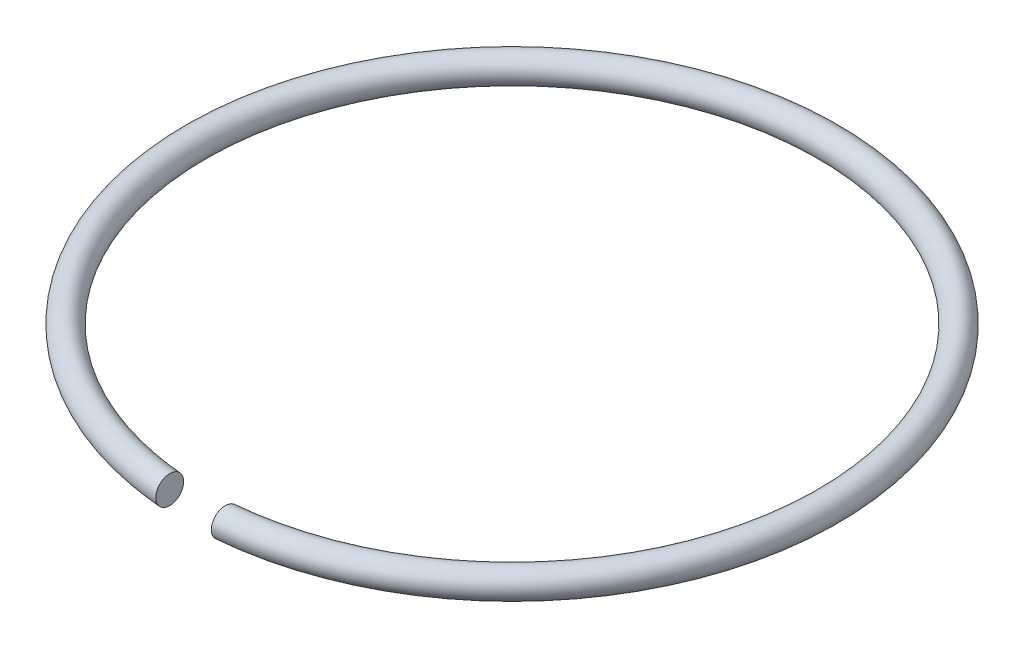
ISO-10303-21;
HEADER;
FILE_DESCRIPTION(('STEP AP214'),'2;1');
FILE_NAME('part.step','',(''),(''),'','','');
FILE_SCHEMA(('AUTOMOTIVE_DESIGN { 1 0 10303 214 1 1 1 1 }'));
ENDSEC;
DATA;
#1=APPLICATION_CONTEXT('core data for automotive mechanical design processes');
#2=APPLICATION_PROTOCOL_DEFINITION('international standard','automotive_design',2000,#1);
#3=PRODUCT_CONTEXT('',#1,'mechanical');
#4=PRODUCT('Part','Part','',(#3));
#5=PRODUCT_RELATED_PRODUCT_CATEGORY('part','',(#4));
#6=PRODUCT_DEFINITION_FORMATION('','',#4);
#7=PRODUCT_DEFINITION_CONTEXT('part definition',#1,'design');
#8=PRODUCT_DEFINITION('design','',#6,#7);
#9=PRODUCT_DEFINITION_SHAPE('','',#8);
#10=(LENGTH_UNIT() NAMED_UNIT(*) SI_UNIT(.MILLI.,.METRE.));
#11=(NAMED_UNIT(*) PLANE_ANGLE_UNIT() SI_UNIT($,.RADIAN.));
#12=(NAMED_UNIT(*) SI_UNIT($,.STERADIAN.) SOLID_ANGLE_UNIT());
#13=UNCERTAINTY_MEASURE_WITH_UNIT(LENGTH_MEASURE(1.E-05),#10,'distance_accuracy_value','');
#14=(GEOMETRIC_REPRESENTATION_CONTEXT(3) GLOBAL_UNCERTAINTY_ASSIGNED_CONTEXT((#13)) GLOBAL_UNIT_ASSIGNED_CONTEXT((#10,
#11,#12)) REPRESENTATION_CONTEXT('',''));
#15=CARTESIAN_POINT('',(0.,0.,0.));
#16=DIRECTION('',(0.,0.,1.));
#17=DIRECTION('',(1.,0.,0.));
#18=AXIS2_PLACEMENT_3D('',#15,#16,#17);
#19=CARTESIAN_POINT('',(1.016,-0.508000000000002,12.065));
#20=DIRECTION('',(1.,0.,0.));
#21=DIRECTION('',(0.,0.,-1.));
#22=AXIS2_PLACEMENT_3D('',#19,#20,#21);
#23=PLANE('',#22);
#24=CARTESIAN_POINT('',(1.016,0.,11.0021881914463));
#25=CARTESIAN_POINT('',(1.01599999999988,0.0284294254282647,11.002190583123));
#26=CARTESIAN_POINT('',(1.01599999999947,0.0568849038649454,11.0045938886173));
#27=CARTESIAN_POINT('',(1.01600000000053,0.113034958975677,11.0141531431692));
#28=CARTESIAN_POINT('',(1.01600000000202,0.140727771292777,11.0213192825623));
#29=CARTESIAN_POINT('',(1.01600000000181,0.194486496065068,11.0401909342891));
#30=CARTESIAN_POINT('',(1.01600000000012,0.220554329348488,11.051890964449));
#31=CARTESIAN_POINT('',(1.01599999999989,0.270362155211176,11.0794941722875));
#32=CARTESIAN_POINT('',(1.01600000000135,0.294101929852248,11.0953977429612));
#33=CARTESIAN_POINT('',(1.01600000000149,0.338628653416022,11.1309834630833));
#34=CARTESIAN_POINT('',(1.01600000000017,0.359410077022896,11.1506725256422));
#35=CARTESIAN_POINT('',(1.01599999999983,0.397390244534181,11.1932495679577));
#36=CARTESIAN_POINT('',(1.01600000000082,0.41458861044417,11.2161378847944));
#37=CARTESIAN_POINT('',(1.016000000001,0.444974360094845,11.2645429541088));
#38=CARTESIAN_POINT('',(1.01600000000019,0.458148375790015,11.2900680978369));
#39=CARTESIAN_POINT('',(1.01599999999981,0.480058310010507,11.3429955090002));
#40=CARTESIAN_POINT('',(1.01600000000024,0.48878842486363,11.3704001783692));
#41=CARTESIAN_POINT('',(1.01600000000045,0.501561594247735,11.4263631235798));
#42=CARTESIAN_POINT('',(1.01600000000022,0.505591237961896,11.4549244607694));
#43=CARTESIAN_POINT('',(1.01599999999978,0.508806179484768,11.5123185594703));
#44=CARTESIAN_POINT('',(1.01599999999958,0.507991437597564,11.5411513232038));
#45=CARTESIAN_POINT('',(1.01599999999981,0.501532258401634,11.5983331603043));
#46=CARTESIAN_POINT('',(1.01600000000025,0.495877574663016,11.6266810772633));
#47=CARTESIAN_POINT('',(1.01599999999975,0.479891814457477,11.6819864642457));
#48=CARTESIAN_POINT('',(1.01599999999882,0.46956681162782,11.708945689667));
#49=CARTESIAN_POINT('',(1.01599999999907,0.444534168956976,11.7607344757728));
#50=CARTESIAN_POINT('',(1.01600000000024,0.429828141336879,11.7855648155678));
#51=CARTESIAN_POINT('',(1.01599999999976,0.396445597375292,11.8323922252058));
#52=CARTESIAN_POINT('',(1.01599999999811,0.377769479197716,11.8543895788164));
#53=CARTESIAN_POINT('',(1.01599999999832,0.337033192944771,11.8948595508593));
#54=CARTESIAN_POINT('',(1.01600000000017,0.314983000662786,11.9133422108725));
#55=CARTESIAN_POINT('',(1.01599999999983,0.268084027520676,11.9463258118425));
#56=CARTESIAN_POINT('',(1.01599999999764,0.243235525411371,11.960827148901));
#57=CARTESIAN_POINT('',(1.01599999999781,0.19151509813325,11.9853982923613));
#58=CARTESIAN_POINT('',(1.01600000000016,0.164648309706877,11.995478930349));
#59=CARTESIAN_POINT('',(1.01599999999984,0.109645296007527,12.0109497517924));
#60=CARTESIAN_POINT('',(1.01599999999719,0.0815119405992061,12.0163500280875));
#61=CARTESIAN_POINT('',(1.01599999999786,0.0354962208620399,12.0212123144998));
#62=CARTESIAN_POINT('',(1.01599999999931,0.0177531633513322,12.0221464261397));
#63=CARTESIAN_POINT('',(1.01600000000111,-0.028441993150694,12.0221425635904));
#64=CARTESIAN_POINT('',(1.0160000000003,-0.0569099245710851,12.0197388273117));
#65=CARTESIAN_POINT('',(1.0159999999997,-0.113084907823847,12.0101774466869));
#66=CARTESIAN_POINT('',(1.01599999999992,-0.140790197623294,12.0030096218306));
#67=CARTESIAN_POINT('',(1.01600000000008,-0.19457392836147,11.9841320040974));
#68=CARTESIAN_POINT('',(1.01600000000002,-0.220654255485921,11.9724275955586));
#69=CARTESIAN_POINT('',(1.01599999999998,-0.270485001220956,11.9448119189907));
#70=CARTESIAN_POINT('',(1.01599999999999,-0.294235213002547,11.9289002779757));
#71=CARTESIAN_POINT('',(1.01600000000002,-0.338770097625574,11.8933010975137));
#72=CARTESIAN_POINT('',(1.01600000000002,-0.359550419129078,11.8736081147823));
#73=CARTESIAN_POINT('',(1.01599999999998,-0.397525290861644,11.8310216509776));
#74=CARTESIAN_POINT('',(1.01599999999994,-0.414719475433313,11.8081278439322));
#75=CARTESIAN_POINT('',(1.01600000000006,-0.445083848919558,11.7597251366701));
#76=CARTESIAN_POINT('',(1.01600000000023,-0.458243049736337,11.73420934383));
#77=CARTESIAN_POINT('',(1.01599999999978,-0.480124548826469,11.6813028742232));
#78=CARTESIAN_POINT('',(1.01599999999916,-0.48884105132415,11.6539098009789));
#79=CARTESIAN_POINT('',(1.01599999999915,-0.5015889124166,11.5979750126648));
#80=CARTESIAN_POINT('',(1.01599999999975,-0.505607317878985,11.5694303453432));
#81=CARTESIAN_POINT('',(1.01600000000025,-0.50880521853477,11.5120711365049));
#82=CARTESIAN_POINT('',(1.01600000000013,-0.507984651567565,11.483256591526));
#83=CARTESIAN_POINT('',(1.01599999999983,-0.50151944597182,11.426097333919));
#84=CARTESIAN_POINT('',(1.01599999999963,-0.495862235802401,11.3977540420785));
#85=CARTESIAN_POINT('',(1.01600000000037,-0.479875249908818,11.3424570637295));
#86=CARTESIAN_POINT('',(1.0160000000013,-0.469551520610067,11.3155016291558));
#87=CARTESIAN_POINT('',(1.01600000000097,-0.444517767833764,11.2637022133226));
#88=CARTESIAN_POINT('',(1.01599999999971,-0.42980666937832,11.2388587514505));
#89=CARTESIAN_POINT('',(1.01600000000029,-0.396412525354336,11.1920055012126));
#90=CARTESIAN_POINT('',(1.01600000000214,-0.377729872085696,11.1699954333159));
#91=CARTESIAN_POINT('',(1.01600000000229,-0.336975107552579,11.1294979547427));
#92=CARTESIAN_POINT('',(1.01600000000062,-0.31491241699344,11.1110010637282));
#93=CARTESIAN_POINT('',(1.01599999999938,-0.267985097978753,11.0779933019195));
#94=CARTESIAN_POINT('',(1.01599999999983,-0.24312076189516,11.063482015741));
#95=CARTESIAN_POINT('',(1.01600000000016,-0.191377294470339,11.0389029389074));
#96=CARTESIAN_POINT('',(1.01600000000005,-0.164504227622367,11.0288223589627));
#97=CARTESIAN_POINT('',(1.01599999999995,-0.10948817712879,11.0133560128469));
#98=CARTESIAN_POINT('',(1.01599999999996,-0.0813480749306568,11.0079601091308));
#99=CARTESIAN_POINT('',(1.01600000000003,-0.0353822985042012,11.0031154652608));
#100=CARTESIAN_POINT('',(1.01600000000007,-0.0176961964645014,11.0021867027218));
#101=CARTESIAN_POINT('',(1.016,0.,11.0021881914463));
#102=B_SPLINE_CURVE_WITH_KNOTS('',3,(#24,#25,#26,#27,#28,#29,#30,#31,#32,#33,#34,#35,#36,#37,
#38,#39,#40,#41,#42,#43,#44,#45,#46,#47,#48,#49,#50,#51,#52,#53,#54,#55,#56,#57,#58,#59,#60,#61,
#62,#63,#64,#65,#66,#67,#68,#69,#70,#71,#72,#73,#74,#75,#76,#77,#78,#79,#80,#81,#82,#83,#84,#85,
#86,#87,#88,#89,#90,#91,#92,#93,#94,#95,#96,#97,#98,#99,#100,#101),.UNSPECIFIED.,.T.,.F.,(4,2,2,
2,2,2,2,2,2,2,2,2,2,2,2,2,2,2,2,2,2,2,2,2,2,2,2,2,2,2,2,2,2,2,2,2,2,2,4),(0.,0.0852328090845258,
0.170648567862555,0.255961366458109,0.341282143892259,0.426760241109638,0.51224735127185,
0.598015418794374,0.683895212664837,0.770019433694663,0.856144360445442,0.942452070788964,
1.02864786130922,1.11481197080188,1.20096744289288,1.28687294119875,1.37276988967162,
1.45845518144213,1.54395523643673,1.59717997786295,1.68245028722325,1.76790340140116,
1.8532554028289,1.93861497355016,2.02409835423392,2.10959044690103,2.19531332593613,
2.28114775137678,2.36721827712732,2.45328990852741,2.53958594229618,2.62577048108598,
2.7119761538837,2.79817331546169,2.88413446150573,2.97008664517683,3.0557890707895,
3.1413055724873,3.19435963573552),.UNSPECIFIED.);
#103=CARTESIAN_POINT('',(1.016,0.,11.0021881914463));
#104=VERTEX_POINT('',#103);
#105=EDGE_CURVE('E19',#104,#104,#102,.T.);
#106=ORIENTED_EDGE('',*,*,#105,.F.);
#107=EDGE_LOOP('',(#106));
#108=FACE_BOUND('',#107,.T.);
#109=ADVANCED_FACE('F15',(#108),#23,.F.);
#110=CARTESIAN_POINT('',(-1.016,-0.508000000000002,12.065));
#111=DIRECTION('',(-1.,0.,0.));
#112=DIRECTION('',(0.,0.,1.));
#113=AXIS2_PLACEMENT_3D('',#110,#111,#112);
#114=PLANE('',#113);
#115=CARTESIAN_POINT('',(-1.016,0.,12.0221449417315));
#116=CARTESIAN_POINT('',(-1.01600000000111,0.0284419931506928,12.0221425635904));
#117=CARTESIAN_POINT('',(-1.0160000000003,0.0569099245710839,12.0197388273117));
#118=CARTESIAN_POINT('',(-1.0159999999997,0.113084907823845,12.0101774466869));
#119=CARTESIAN_POINT('',(-1.01599999999992,0.140790197623293,12.0030096218306));
#120=CARTESIAN_POINT('',(-1.01600000000008,0.194573928361469,11.9841320040974));
#121=CARTESIAN_POINT('',(-1.01600000000002,0.22065425548592,11.9724275955586));
#122=CARTESIAN_POINT('',(-1.01599999999998,0.270485001220954,11.9448119189907));
#123=CARTESIAN_POINT('',(-1.01599999999999,0.294235213002546,11.9289002779757));
#124=CARTESIAN_POINT('',(-1.01600000000001,0.338770097625573,11.8933010975137));
#125=CARTESIAN_POINT('',(-1.01600000000002,0.359550419129078,11.8736081147823));
#126=CARTESIAN_POINT('',(-1.01599999999998,0.397525290861643,11.8310216509776));
#127=CARTESIAN_POINT('',(-1.01599999999994,0.414719475433311,11.8081278439322));
#128=CARTESIAN_POINT('',(-1.01600000000006,0.445083848919557,11.7597251366701));
#129=CARTESIAN_POINT('',(-1.01600000000023,0.458243049736336,11.73420934383));
#130=CARTESIAN_POINT('',(-1.01599999999977,0.480124548826468,11.6813028742232));
#131=CARTESIAN_POINT('',(-1.01599999999915,0.488841051324149,11.6539098009789));
#132=CARTESIAN_POINT('',(-1.01599999999914,0.501588912416599,11.5979750126648));
#133=CARTESIAN_POINT('',(-1.01599999999975,0.505607317878983,11.5694303453432));
#134=CARTESIAN_POINT('',(-1.01600000000025,0.508805218534769,11.5120711365049));
#135=CARTESIAN_POINT('',(-1.01600000000013,0.507984651567564,11.483256591526));
#136=CARTESIAN_POINT('',(-1.01599999999983,0.501519445971819,11.426097333919));
#137=CARTESIAN_POINT('',(-1.01599999999963,0.4958622358024,11.3977540420785));
#138=CARTESIAN_POINT('',(-1.01600000000037,0.479875249908817,11.3424570637295));
#139=CARTESIAN_POINT('',(-1.0160000000013,0.469551520610066,11.3155016291558));
#140=CARTESIAN_POINT('',(-1.01600000000097,0.444517767833762,11.2637022133226));
#141=CARTESIAN_POINT('',(-1.01599999999971,0.429806669378319,11.2388587514505));
#142=CARTESIAN_POINT('',(-1.01600000000029,0.396412525354336,11.1920055012126));
#143=CARTESIAN_POINT('',(-1.01600000000213,0.377729872085696,11.1699954333159));
#144=CARTESIAN_POINT('',(-1.01600000000228,0.336975107552578,11.1294979547427));
#145=CARTESIAN_POINT('',(-1.01600000000061,0.314912416993439,11.1110010637282));
#146=CARTESIAN_POINT('',(-1.01599999999939,0.267985097978752,11.0779933019195));
#147=CARTESIAN_POINT('',(-1.01599999999983,0.243120761895159,11.063482015741));
#148=CARTESIAN_POINT('',(-1.01600000000017,0.191377294470338,11.0389029389074));
#149=CARTESIAN_POINT('',(-1.01600000000005,0.164504227622367,11.0288223589627));
#150=CARTESIAN_POINT('',(-1.01599999999995,0.10948817712879,11.0133560128469));
#151=CARTESIAN_POINT('',(-1.01599999999995,0.0813480749306565,11.0079601091308));
#152=CARTESIAN_POINT('',(-1.01600000000003,0.0353822985042024,11.0031154652608));
#153=CARTESIAN_POINT('',(-1.01600000000007,0.0176961964645039,11.0021867027218));
#154=CARTESIAN_POINT('',(-1.01599999999988,-0.0284294254282611,11.002190583123));
#155=CARTESIAN_POINT('',(-1.01599999999947,-0.0568849038649419,11.0045938886173));
#156=CARTESIAN_POINT('',(-1.01600000000053,-0.113034958975674,11.0141531431692));
#157=CARTESIAN_POINT('',(-1.01600000000201,-0.140727771292773,11.0213192825623));
#158=CARTESIAN_POINT('',(-1.0160000000018,-0.194486496065065,11.0401909342891));
#159=CARTESIAN_POINT('',(-1.01600000000011,-0.220554329348485,11.051890964449));
#160=CARTESIAN_POINT('',(-1.01599999999988,-0.270362155211174,11.0794941722875));
#161=CARTESIAN_POINT('',(-1.01600000000134,-0.294101929852246,11.0953977429612));
#162=CARTESIAN_POINT('',(-1.01600000000149,-0.33862865341602,11.1309834630833));
#163=CARTESIAN_POINT('',(-1.01600000000017,-0.359410077022894,11.1506725256422));
#164=CARTESIAN_POINT('',(-1.01599999999983,-0.397390244534178,11.1932495679577));
#165=CARTESIAN_POINT('',(-1.01600000000081,-0.414588610444168,11.2161378847944));
#166=CARTESIAN_POINT('',(-1.016000000001,-0.444974360094844,11.2645429541088));
#167=CARTESIAN_POINT('',(-1.01600000000019,-0.458148375790014,11.2900680978369));
#168=CARTESIAN_POINT('',(-1.01599999999981,-0.480058310010506,11.3429955090002));
#169=CARTESIAN_POINT('',(-1.01600000000024,-0.48878842486363,11.3704001783692));
#170=CARTESIAN_POINT('',(-1.01600000000044,-0.501561594247736,11.4263631235798));
#171=CARTESIAN_POINT('',(-1.01600000000022,-0.505591237961897,11.4549244607694));
#172=CARTESIAN_POINT('',(-1.01599999999978,-0.508806179484769,11.5123185594703));
#173=CARTESIAN_POINT('',(-1.01599999999958,-0.507991437597566,11.5411513232038));
#174=CARTESIAN_POINT('',(-1.01599999999981,-0.501532258401636,11.5983331603043));
#175=CARTESIAN_POINT('',(-1.01600000000025,-0.495877574663017,11.6266810772633));
#176=CARTESIAN_POINT('',(-1.01599999999975,-0.479891814457479,11.6819864642457));
#177=CARTESIAN_POINT('',(-1.01599999999882,-0.469566811627821,11.708945689667));
#178=CARTESIAN_POINT('',(-1.01599999999907,-0.444534168956978,11.7607344757728));
#179=CARTESIAN_POINT('',(-1.01600000000024,-0.429828141336881,11.7855648155678));
#180=CARTESIAN_POINT('',(-1.01599999999976,-0.396445597375296,11.8323922252058));
#181=CARTESIAN_POINT('',(-1.01599999999811,-0.37776947919772,11.8543895788164));
#182=CARTESIAN_POINT('',(-1.01599999999832,-0.337033192944776,11.8948595508593));
#183=CARTESIAN_POINT('',(-1.01600000000017,-0.314983000662791,11.9133422108725));
#184=CARTESIAN_POINT('',(-1.01599999999983,-0.268084027520681,11.9463258118425));
#185=CARTESIAN_POINT('',(-1.01599999999764,-0.243235525411376,11.960827148901));
#186=CARTESIAN_POINT('',(-1.01599999999781,-0.191515098133254,11.9853982923613));
#187=CARTESIAN_POINT('',(-1.01600000000016,-0.164648309706882,11.995478930349));
#188=CARTESIAN_POINT('',(-1.01599999999984,-0.109645296007532,12.0109497517924));
#189=CARTESIAN_POINT('',(-1.01599999999719,-0.0815119405992116,12.0163500280875));
#190=CARTESIAN_POINT('',(-1.01599999999786,-0.035496220862044,12.0212123144998));
#191=CARTESIAN_POINT('',(-1.01599999999931,-0.0177531633513348,12.0221464261397));
#192=CARTESIAN_POINT('',(-1.016,0.,12.0221449417315));
#193=B_SPLINE_CURVE_WITH_KNOTS('',3,(#115,#116,#117,#118,#119,#120,#121,#122,#123,#124,#125,
#126,#127,#128,#129,#130,#131,#132,#133,#134,#135,#136,#137,#138,#139,#140,#141,#142,#143,#144,
#145,#146,#147,#148,#149,#150,#151,#152,#153,#154,#155,#156,#157,#158,#159,#160,#161,#162,#163,
#164,#165,#166,#167,#168,#169,#170,#171,#172,#173,#174,#175,#176,#177,#178,#179,#180,#181,#182,
#183,#184,#185,#186,#187,#188,#189,#190,#191,#192),.UNSPECIFIED.,.T.,.F.,(4,2,2,2,2,2,2,2,2,2,2,
2,2,2,2,2,2,2,2,2,2,2,2,2,2,2,2,2,2,2,2,2,2,2,2,2,2,2,4),(0.,0.0852703093602989,
0.170723423538209,0.256075424965947,0.341434995687206,0.426918376370967,0.512410469038082,
0.598133348073182,0.683967773513834,0.770038299264371,0.856109930664464,0.942405964433225,
1.02859050322303,1.11479617602075,1.20099333759874,1.28695448364278,1.37290666731388,
1.45860909292655,1.54412559462435,1.59717965787257,1.68241246695709,1.76782822573512,
1.85314102433068,1.93846180176483,2.02393989898221,2.10942700914442,2.19519507666694,
2.28107487053741,2.36719909156723,2.45332401831801,2.53963172866154,2.62582751918179,
2.71199162867446,2.79814710076545,2.88405259907132,2.96994954754419,3.0556348393147,
3.1411348943093,3.19435963573552),.UNSPECIFIED.);
#194=CARTESIAN_POINT('',(-1.016,0.,12.0221449417315));
#195=VERTEX_POINT('',#194);
#196=EDGE_CURVE('E10',#195,#195,#193,.T.);
#197=ORIENTED_EDGE('',*,*,#196,.F.);
#198=EDGE_LOOP('',(#197));
#199=FACE_BOUND('',#198,.T.);
#200=ADVANCED_FACE('F33',(#199),#114,.F.);
#201=CARTESIAN_POINT('',(0.,0.,0.));
#202=DIRECTION('',(0.,1.,0.));
#203=DIRECTION('',(-1.,0.,0.));
#204=AXIS2_PLACEMENT_3D('',#201,#202,#203);
#205=TOROIDAL_SURFACE('',#204,11.557,0.508);
#206=ORIENTED_EDGE('',*,*,#196,.T.);
#207=EDGE_LOOP('',(#206));
#208=FACE_BOUND('',#207,.T.);
#209=ORIENTED_EDGE('',*,*,#105,.T.);
#210=EDGE_LOOP('',(#209));
#211=FACE_BOUND('',#210,.T.);
#212=ADVANCED_FACE('F35',(#208,#211),#205,.T.);
#213=CLOSED_SHELL('',(#109,#200,#212));
#214=MANIFOLD_SOLID_BREP('B1',#213);
#215=ADVANCED_BREP_SHAPE_REPRESENTATION('',(#18,#214),#14);
#216=SHAPE_DEFINITION_REPRESENTATION(#9,#215);
ENDSEC;
END-ISO-10303-21;
